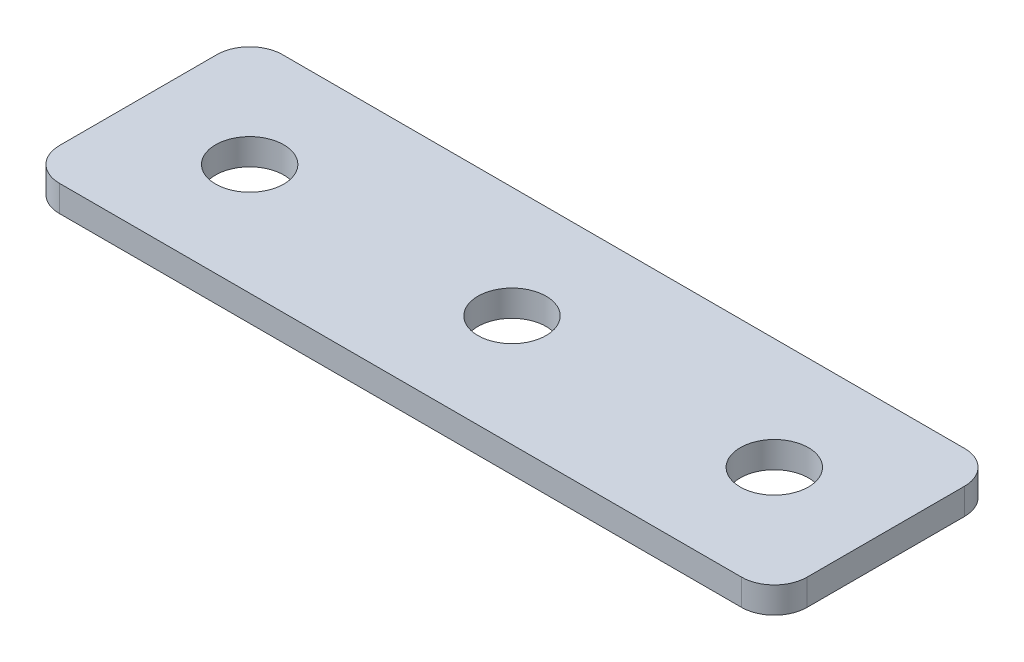
ISO-10303-21;
HEADER;
FILE_DESCRIPTION(('STEP AP214'),'2;1');
FILE_NAME('part.step','',(''),(''),'','','');
FILE_SCHEMA(('AUTOMOTIVE_DESIGN { 1 0 10303 214 1 1 1 1 }'));
ENDSEC;
DATA;
#1=APPLICATION_CONTEXT('core data for automotive mechanical design processes');
#2=APPLICATION_PROTOCOL_DEFINITION('international standard','automotive_design',2000,#1);
#3=PRODUCT_CONTEXT('',#1,'mechanical');
#4=PRODUCT('Part','Part','',(#3));
#5=PRODUCT_RELATED_PRODUCT_CATEGORY('part','',(#4));
#6=PRODUCT_DEFINITION_FORMATION('','',#4);
#7=PRODUCT_DEFINITION_CONTEXT('part definition',#1,'design');
#8=PRODUCT_DEFINITION('design','',#6,#7);
#9=PRODUCT_DEFINITION_SHAPE('','',#8);
#10=(LENGTH_UNIT() NAMED_UNIT(*) SI_UNIT(.MILLI.,.METRE.));
#11=(NAMED_UNIT(*) PLANE_ANGLE_UNIT() SI_UNIT($,.RADIAN.));
#12=(NAMED_UNIT(*) SI_UNIT($,.STERADIAN.) SOLID_ANGLE_UNIT());
#13=UNCERTAINTY_MEASURE_WITH_UNIT(LENGTH_MEASURE(1.E-05),#10,'distance_accuracy_value','');
#14=(GEOMETRIC_REPRESENTATION_CONTEXT(3) GLOBAL_UNCERTAINTY_ASSIGNED_CONTEXT((#13)) GLOBAL_UNIT_ASSIGNED_CONTEXT((#10,
#11,#12)) REPRESENTATION_CONTEXT('',''));
#15=CARTESIAN_POINT('',(0.,0.,0.));
#16=DIRECTION('',(0.,0.,1.));
#17=DIRECTION('',(1.,0.,0.));
#18=AXIS2_PLACEMENT_3D('',#15,#16,#17);
#19=CARTESIAN_POINT('',(-20.9120032783016,0.624792376219375,-0.712525045059916));
#20=DIRECTION('',(0.,-1.,0.));
#21=DIRECTION('',(0.,0.,-1.));
#22=AXIS2_PLACEMENT_3D('',#19,#20,#21);
#23=PLANE('',#22);
#24=CARTESIAN_POINT('',(19.0879967216984,0.624792376219375,-0.712525045059916));
#25=DIRECTION('',(0.,1.,0.));
#26=DIRECTION('',(0.,0.,1.));
#27=AXIS2_PLACEMENT_3D('',#24,#25,#26);
#28=CIRCLE('',#27,2.6);
#29=CARTESIAN_POINT('',(19.0879967216984,0.624792376219375,1.88747495494008));
#30=VERTEX_POINT('',#29);
#31=EDGE_CURVE('E163',#30,#30,#28,.T.);
#32=ORIENTED_EDGE('',*,*,#31,.T.);
#33=EDGE_LOOP('',(#32));
#34=FACE_BOUND('',#33,.T.);
#35=CARTESIAN_POINT('',(-0.912003278301585,0.624792376219375,-0.712525045059906));
#36=DIRECTION('',(0.,1.,0.));
#37=DIRECTION('',(0.,0.,1.));
#38=AXIS2_PLACEMENT_3D('',#35,#36,#37);
#39=CIRCLE('',#38,2.6);
#40=CARTESIAN_POINT('',(-0.912003278301585,0.624792376219375,1.88747495494009));
#41=VERTEX_POINT('',#40);
#42=EDGE_CURVE('E157',#41,#41,#39,.T.);
#43=ORIENTED_EDGE('',*,*,#42,.T.);
#44=EDGE_LOOP('',(#43));
#45=FACE_BOUND('',#44,.T.);
#46=CARTESIAN_POINT('',(-20.9120032783016,0.624792376219375,-0.712525045059916));
#47=DIRECTION('',(0.,1.,0.));
#48=DIRECTION('',(0.,0.,1.));
#49=AXIS2_PLACEMENT_3D('',#46,#47,#48);
#50=CIRCLE('',#49,2.6);
#51=CARTESIAN_POINT('',(-20.9120032783016,0.624792376219375,1.88747495494008));
#52=VERTEX_POINT('',#51);
#53=EDGE_CURVE('E103',#52,#52,#50,.T.);
#54=ORIENTED_EDGE('',*,*,#53,.T.);
#55=EDGE_LOOP('',(#54));
#56=FACE_BOUND('',#55,.T.);
#57=DIRECTION('',(0.,0.,-1.));
#58=VECTOR('',#57,1.);
#59=CARTESIAN_POINT('',(27.5879967216983,0.624792376219375,7.78747495494012));
#60=LINE('',#59,#58);
#61=CARTESIAN_POINT('',(27.5879967216983,0.624792376219375,5.28747495494012));
#62=VERTEX_POINT('',#61);
#63=CARTESIAN_POINT('',(27.5879967216983,0.624792376219375,-6.71252504505996));
#64=VERTEX_POINT('',#63);
#65=EDGE_CURVE('E150',#62,#64,#60,.T.);
#66=ORIENTED_EDGE('',*,*,#65,.F.);
#67=CARTESIAN_POINT('',(25.0879967216983,0.624792376219375,5.28747495494012));
#68=DIRECTION('',(0.,-1.,0.));
#69=DIRECTION('',(0.,0.,-1.));
#70=AXIS2_PLACEMENT_3D('',#67,#68,#69);
#71=CIRCLE('',#70,2.5);
#72=CARTESIAN_POINT('',(25.0879967216983,0.624792376219375,7.78747495494012));
#73=VERTEX_POINT('',#72);
#74=EDGE_CURVE('E130',#62,#73,#71,.T.);
#75=ORIENTED_EDGE('',*,*,#74,.T.);
#76=DIRECTION('',(1.,0.,0.));
#77=VECTOR('',#76,1.);
#78=CARTESIAN_POINT('',(-12.4120032783015,0.624792376219375,7.78747495494012));
#79=LINE('',#78,#77);
#80=CARTESIAN_POINT('',(-26.9120032783017,0.624792376219375,7.78747495494012));
#81=VERTEX_POINT('',#80);
#82=EDGE_CURVE('E146',#81,#73,#79,.T.);
#83=ORIENTED_EDGE('',*,*,#82,.F.);
#84=CARTESIAN_POINT('',(-26.9120032783017,0.624792376219375,5.28747495494012));
#85=DIRECTION('',(0.,-1.,0.));
#86=DIRECTION('',(0.,0.,-1.));
#87=AXIS2_PLACEMENT_3D('',#84,#85,#86);
#88=CIRCLE('',#87,2.5);
#89=CARTESIAN_POINT('',(-29.4120032783017,0.624792376219375,5.28747495494012));
#90=VERTEX_POINT('',#89);
#91=EDGE_CURVE('E106',#81,#90,#88,.T.);
#92=ORIENTED_EDGE('',*,*,#91,.T.);
#93=DIRECTION('',(0.,0.,1.));
#94=VECTOR('',#93,1.);
#95=CARTESIAN_POINT('',(-29.4120032783017,0.624792376219375,-9.21252504505995));
#96=LINE('',#95,#94);
#97=CARTESIAN_POINT('',(-29.4120032783017,0.624792376219375,-6.71252504505995));
#98=VERTEX_POINT('',#97);
#99=EDGE_CURVE('E107',#98,#90,#96,.T.);
#100=ORIENTED_EDGE('',*,*,#99,.F.);
#101=CARTESIAN_POINT('',(-26.9120032783017,0.624792376219375,-6.71252504505995));
#102=DIRECTION('',(0.,-1.,0.));
#103=DIRECTION('',(0.,0.,-1.));
#104=AXIS2_PLACEMENT_3D('',#101,#102,#103);
#105=CIRCLE('',#104,2.5);
#106=CARTESIAN_POINT('',(-26.9120032783017,0.624792376219375,-9.21252504505995));
#107=VERTEX_POINT('',#106);
#108=EDGE_CURVE('E31',#98,#107,#105,.T.);
#109=ORIENTED_EDGE('',*,*,#108,.T.);
#110=DIRECTION('',(-1.,0.,0.));
#111=VECTOR('',#110,1.);
#112=CARTESIAN_POINT('',(27.5879967216983,0.624792376219375,-9.21252504505996));
#113=LINE('',#112,#111);
#114=CARTESIAN_POINT('',(25.0879967216983,0.624792376219375,-9.21252504505996));
#115=VERTEX_POINT('',#114);
#116=EDGE_CURVE('E111',#115,#107,#113,.T.);
#117=ORIENTED_EDGE('',*,*,#116,.F.);
#118=CARTESIAN_POINT('',(25.0879967216983,0.624792376219375,-6.71252504505996));
#119=DIRECTION('',(0.,-1.,0.));
#120=DIRECTION('',(0.,0.,-1.));
#121=AXIS2_PLACEMENT_3D('',#118,#119,#120);
#122=CIRCLE('',#121,2.5);
#123=EDGE_CURVE('E128',#115,#64,#122,.T.);
#124=ORIENTED_EDGE('',*,*,#123,.T.);
#125=EDGE_LOOP('',(#66,#75,#83,#92,#100,#109,#117,#124));
#126=FACE_BOUND('',#125,.T.);
#127=ADVANCED_FACE('F16',(#34,#45,#56,#126),#23,.T.);
#128=CARTESIAN_POINT('',(-12.4120032783015,0.624792376219375,7.78747495494012));
#129=DIRECTION('',(0.,0.,1.));
#130=DIRECTION('',(1.,0.,0.));
#131=AXIS2_PLACEMENT_3D('',#128,#129,#130);
#132=PLANE('',#131);
#133=ORIENTED_EDGE('',*,*,#82,.T.);
#134=DIRECTION('',(0.,1.,0.));
#135=VECTOR('',#134,1.);
#136=CARTESIAN_POINT('',(25.0879967216983,0.624792376219375,7.78747495494012));
#137=LINE('',#136,#135);
#138=CARTESIAN_POINT('',(25.0879967216983,2.62479237621938,7.78747495494012));
#139=VERTEX_POINT('',#138);
#140=EDGE_CURVE('E93',#73,#139,#137,.T.);
#141=ORIENTED_EDGE('',*,*,#140,.T.);
#142=DIRECTION('',(1.,0.,0.));
#143=VECTOR('',#142,1.);
#144=CARTESIAN_POINT('',(-12.4120032783015,2.62479237621938,7.78747495494012));
#145=LINE('',#144,#143);
#146=CARTESIAN_POINT('',(-26.9120032783017,2.62479237621938,7.78747495494012));
#147=VERTEX_POINT('',#146);
#148=EDGE_CURVE('E85',#147,#139,#145,.T.);
#149=ORIENTED_EDGE('',*,*,#148,.F.);
#150=DIRECTION('',(0.,1.,0.));
#151=VECTOR('',#150,1.);
#152=CARTESIAN_POINT('',(-26.9120032783017,0.624792376219375,7.78747495494012));
#153=LINE('',#152,#151);
#154=EDGE_CURVE('E99',#147,#81,#153,.F.);
#155=ORIENTED_EDGE('',*,*,#154,.T.);
#156=EDGE_LOOP('',(#133,#141,#149,#155));
#157=FACE_BOUND('',#156,.T.);
#158=ADVANCED_FACE('F98',(#157),#132,.T.);
#159=CARTESIAN_POINT('',(-29.4120032783017,0.624792376219375,-9.21252504505995));
#160=DIRECTION('',(-1.,0.,0.));
#161=DIRECTION('',(0.,0.,1.));
#162=AXIS2_PLACEMENT_3D('',#159,#160,#161);
#163=PLANE('',#162);
#164=DIRECTION('',(0.,0.,1.));
#165=VECTOR('',#164,1.);
#166=CARTESIAN_POINT('',(-29.4120032783017,2.62479237621938,-9.21252504505995));
#167=LINE('',#166,#165);
#168=CARTESIAN_POINT('',(-29.4120032783017,2.62479237621938,-6.71252504505995));
#169=VERTEX_POINT('',#168);
#170=CARTESIAN_POINT('',(-29.4120032783017,2.62479237621938,5.28747495494012));
#171=VERTEX_POINT('',#170);
#172=EDGE_CURVE('E87',#169,#171,#167,.T.);
#173=ORIENTED_EDGE('',*,*,#172,.F.);
#174=DIRECTION('',(0.,1.,0.));
#175=VECTOR('',#174,1.);
#176=CARTESIAN_POINT('',(-29.4120032783017,0.624792376219375,-6.71252504505995));
#177=LINE('',#176,#175);
#178=EDGE_CURVE('E10',#169,#98,#177,.F.);
#179=ORIENTED_EDGE('',*,*,#178,.T.);
#180=ORIENTED_EDGE('',*,*,#99,.T.);
#181=DIRECTION('',(0.,1.,0.));
#182=VECTOR('',#181,1.);
#183=CARTESIAN_POINT('',(-29.4120032783017,0.624792376219375,5.28747495494012));
#184=LINE('',#183,#182);
#185=EDGE_CURVE('E24',#90,#171,#184,.T.);
#186=ORIENTED_EDGE('',*,*,#185,.T.);
#187=EDGE_LOOP('',(#173,#179,#180,#186));
#188=FACE_BOUND('',#187,.T.);
#189=ADVANCED_FACE('F136',(#188),#163,.T.);
#190=CARTESIAN_POINT('',(27.5879967216983,0.624792376219375,-9.21252504505996));
#191=DIRECTION('',(0.,0.,-1.));
#192=DIRECTION('',(-1.,0.,0.));
#193=AXIS2_PLACEMENT_3D('',#190,#191,#192);
#194=PLANE('',#193);
#195=DIRECTION('',(-1.,0.,0.));
#196=VECTOR('',#195,1.);
#197=CARTESIAN_POINT('',(27.5879967216983,2.62479237621938,-9.21252504505996));
#198=LINE('',#197,#196);
#199=CARTESIAN_POINT('',(25.0879967216983,2.62479237621938,-9.21252504505996));
#200=VERTEX_POINT('',#199);
#201=CARTESIAN_POINT('',(-26.9120032783017,2.62479237621938,-9.21252504505995));
#202=VERTEX_POINT('',#201);
#203=EDGE_CURVE('E144',#200,#202,#198,.T.);
#204=ORIENTED_EDGE('',*,*,#203,.F.);
#205=DIRECTION('',(0.,1.,0.));
#206=VECTOR('',#205,1.);
#207=CARTESIAN_POINT('',(25.0879967216983,0.624792376219375,-9.21252504505996));
#208=LINE('',#207,#206);
#209=EDGE_CURVE('E38',#200,#115,#208,.F.);
#210=ORIENTED_EDGE('',*,*,#209,.T.);
#211=ORIENTED_EDGE('',*,*,#116,.T.);
#212=DIRECTION('',(0.,1.,0.));
#213=VECTOR('',#212,1.);
#214=CARTESIAN_POINT('',(-26.9120032783017,0.624792376219375,-9.21252504505995));
#215=LINE('',#214,#213);
#216=EDGE_CURVE('E132',#107,#202,#215,.T.);
#217=ORIENTED_EDGE('',*,*,#216,.T.);
#218=EDGE_LOOP('',(#204,#210,#211,#217));
#219=FACE_BOUND('',#218,.T.);
#220=ADVANCED_FACE('F143',(#219),#194,.T.);
#221=CARTESIAN_POINT('',(27.5879967216983,0.624792376219375,7.78747495494012));
#222=DIRECTION('',(1.,0.,0.));
#223=DIRECTION('',(0.,0.,-1.));
#224=AXIS2_PLACEMENT_3D('',#221,#222,#223);
#225=PLANE('',#224);
#226=DIRECTION('',(0.,0.,-1.));
#227=VECTOR('',#226,1.);
#228=CARTESIAN_POINT('',(27.5879967216983,2.62479237621938,7.78747495494012));
#229=LINE('',#228,#227);
#230=CARTESIAN_POINT('',(27.5879967216983,2.62479237621938,5.28747495494012));
#231=VERTEX_POINT('',#230);
#232=CARTESIAN_POINT('',(27.5879967216983,2.62479237621938,-6.71252504505996));
#233=VERTEX_POINT('',#232);
#234=EDGE_CURVE('E102',#231,#233,#229,.T.);
#235=ORIENTED_EDGE('',*,*,#234,.F.);
#236=DIRECTION('',(0.,1.,0.));
#237=VECTOR('',#236,1.);
#238=CARTESIAN_POINT('',(27.5879967216983,0.624792376219375,5.28747495494012));
#239=LINE('',#238,#237);
#240=EDGE_CURVE('E124',#231,#62,#239,.F.);
#241=ORIENTED_EDGE('',*,*,#240,.T.);
#242=ORIENTED_EDGE('',*,*,#65,.T.);
#243=DIRECTION('',(0.,1.,0.));
#244=VECTOR('',#243,1.);
#245=CARTESIAN_POINT('',(27.5879967216983,0.624792376219375,-6.71252504505996));
#246=LINE('',#245,#244);
#247=EDGE_CURVE('E121',#64,#233,#246,.T.);
#248=ORIENTED_EDGE('',*,*,#247,.T.);
#249=EDGE_LOOP('',(#235,#241,#242,#248));
#250=FACE_BOUND('',#249,.T.);
#251=ADVANCED_FACE('F185',(#250),#225,.T.);
#252=CARTESIAN_POINT('',(-20.9120032783016,2.62479237621938,-0.712525045059916));
#253=DIRECTION('',(0.,-1.,0.));
#254=DIRECTION('',(0.,0.,-1.));
#255=AXIS2_PLACEMENT_3D('',#252,#253,#254);
#256=PLANE('',#255);
#257=CARTESIAN_POINT('',(19.0879967216984,2.62479237621938,-0.712525045059916));
#258=DIRECTION('',(0.,1.,0.));
#259=DIRECTION('',(0.,0.,1.));
#260=AXIS2_PLACEMENT_3D('',#257,#258,#259);
#261=CIRCLE('',#260,2.6);
#262=CARTESIAN_POINT('',(19.0879967216984,2.62479237621938,1.88747495494008));
#263=VERTEX_POINT('',#262);
#264=EDGE_CURVE('E166',#263,#263,#261,.T.);
#265=ORIENTED_EDGE('',*,*,#264,.F.);
#266=EDGE_LOOP('',(#265));
#267=FACE_BOUND('',#266,.T.);
#268=CARTESIAN_POINT('',(-0.912003278301585,2.62479237621938,-0.712525045059906));
#269=DIRECTION('',(0.,1.,0.));
#270=DIRECTION('',(0.,0.,1.));
#271=AXIS2_PLACEMENT_3D('',#268,#269,#270);
#272=CIRCLE('',#271,2.6);
#273=CARTESIAN_POINT('',(-0.912003278301585,2.62479237621938,1.88747495494009));
#274=VERTEX_POINT('',#273);
#275=EDGE_CURVE('E160',#274,#274,#272,.T.);
#276=ORIENTED_EDGE('',*,*,#275,.F.);
#277=EDGE_LOOP('',(#276));
#278=FACE_BOUND('',#277,.T.);
#279=CARTESIAN_POINT('',(-20.9120032783016,2.62479237621938,-0.712525045059916));
#280=DIRECTION('',(0.,1.,0.));
#281=DIRECTION('',(0.,0.,1.));
#282=AXIS2_PLACEMENT_3D('',#279,#280,#281);
#283=CIRCLE('',#282,2.6);
#284=CARTESIAN_POINT('',(-20.9120032783016,2.62479237621938,1.88747495494008));
#285=VERTEX_POINT('',#284);
#286=EDGE_CURVE('E154',#285,#285,#283,.T.);
#287=ORIENTED_EDGE('',*,*,#286,.F.);
#288=EDGE_LOOP('',(#287));
#289=FACE_BOUND('',#288,.T.);
#290=ORIENTED_EDGE('',*,*,#148,.T.);
#291=CARTESIAN_POINT('',(25.0879967216983,2.62479237621938,5.28747495494012));
#292=DIRECTION('',(0.,-1.,0.));
#293=DIRECTION('',(0.,0.,-1.));
#294=AXIS2_PLACEMENT_3D('',#291,#292,#293);
#295=CIRCLE('',#294,2.5);
#296=EDGE_CURVE('E119',#139,#231,#295,.F.);
#297=ORIENTED_EDGE('',*,*,#296,.T.);
#298=ORIENTED_EDGE('',*,*,#234,.T.);
#299=CARTESIAN_POINT('',(25.0879967216983,2.62479237621938,-6.71252504505996));
#300=DIRECTION('',(0.,-1.,0.));
#301=DIRECTION('',(0.,0.,-1.));
#302=AXIS2_PLACEMENT_3D('',#299,#300,#301);
#303=CIRCLE('',#302,2.5);
#304=EDGE_CURVE('E117',#233,#200,#303,.F.);
#305=ORIENTED_EDGE('',*,*,#304,.T.);
#306=ORIENTED_EDGE('',*,*,#203,.T.);
#307=CARTESIAN_POINT('',(-26.9120032783017,2.62479237621938,-6.71252504505995));
#308=DIRECTION('',(0.,-1.,0.));
#309=DIRECTION('',(0.,0.,-1.));
#310=AXIS2_PLACEMENT_3D('',#307,#308,#309);
#311=CIRCLE('',#310,2.5);
#312=EDGE_CURVE('E92',#202,#169,#311,.F.);
#313=ORIENTED_EDGE('',*,*,#312,.T.);
#314=ORIENTED_EDGE('',*,*,#172,.T.);
#315=CARTESIAN_POINT('',(-26.9120032783017,2.62479237621938,5.28747495494012));
#316=DIRECTION('',(0.,-1.,0.));
#317=DIRECTION('',(0.,0.,-1.));
#318=AXIS2_PLACEMENT_3D('',#315,#316,#317);
#319=CIRCLE('',#318,2.5);
#320=EDGE_CURVE('E82',#171,#147,#319,.F.);
#321=ORIENTED_EDGE('',*,*,#320,.T.);
#322=EDGE_LOOP('',(#290,#297,#298,#305,#306,#313,#314,#321));
#323=FACE_BOUND('',#322,.T.);
#324=ADVANCED_FACE('F84',(#267,#278,#289,#323),#256,.F.);
#325=CARTESIAN_POINT('',(-20.9120032783016,0.624792376219375,-0.712525045059916));
#326=DIRECTION('',(0.,1.,0.));
#327=DIRECTION('',(0.,0.,1.));
#328=AXIS2_PLACEMENT_3D('',#325,#326,#327);
#329=CYLINDRICAL_SURFACE('',#328,2.6);
#330=ORIENTED_EDGE('',*,*,#53,.F.);
#331=EDGE_LOOP('',(#330));
#332=FACE_BOUND('',#331,.T.);
#333=ORIENTED_EDGE('',*,*,#286,.T.);
#334=EDGE_LOOP('',(#333));
#335=FACE_BOUND('',#334,.T.);
#336=ADVANCED_FACE('F184',(#332,#335),#329,.F.);
#337=CARTESIAN_POINT('',(-0.912003278301585,0.624792376219375,-0.712525045059906));
#338=DIRECTION('',(0.,1.,0.));
#339=DIRECTION('',(0.,0.,1.));
#340=AXIS2_PLACEMENT_3D('',#337,#338,#339);
#341=CYLINDRICAL_SURFACE('',#340,2.6);
#342=ORIENTED_EDGE('',*,*,#42,.F.);
#343=EDGE_LOOP('',(#342));
#344=FACE_BOUND('',#343,.T.);
#345=ORIENTED_EDGE('',*,*,#275,.T.);
#346=EDGE_LOOP('',(#345));
#347=FACE_BOUND('',#346,.T.);
#348=ADVANCED_FACE('F178',(#344,#347),#341,.F.);
#349=CARTESIAN_POINT('',(19.0879967216984,0.624792376219375,-0.712525045059916));
#350=DIRECTION('',(0.,1.,0.));
#351=DIRECTION('',(0.,0.,1.));
#352=AXIS2_PLACEMENT_3D('',#349,#350,#351);
#353=CYLINDRICAL_SURFACE('',#352,2.6);
#354=ORIENTED_EDGE('',*,*,#31,.F.);
#355=EDGE_LOOP('',(#354));
#356=FACE_BOUND('',#355,.T.);
#357=ORIENTED_EDGE('',*,*,#264,.T.);
#358=EDGE_LOOP('',(#357));
#359=FACE_BOUND('',#358,.T.);
#360=ADVANCED_FACE('F174',(#356,#359),#353,.F.);
#361=CARTESIAN_POINT('',(25.0879967216983,0.624792376219375,5.28747495494012));
#362=DIRECTION('',(0.,1.,0.));
#363=DIRECTION('',(0.,0.,1.));
#364=AXIS2_PLACEMENT_3D('',#361,#362,#363);
#365=CYLINDRICAL_SURFACE('',#364,2.5);
#366=ORIENTED_EDGE('',*,*,#74,.F.);
#367=ORIENTED_EDGE('',*,*,#240,.F.);
#368=ORIENTED_EDGE('',*,*,#296,.F.);
#369=ORIENTED_EDGE('',*,*,#140,.F.);
#370=EDGE_LOOP('',(#366,#367,#368,#369));
#371=FACE_BOUND('',#370,.T.);
#372=ADVANCED_FACE('F177',(#371),#365,.T.);
#373=CARTESIAN_POINT('',(25.0879967216983,0.624792376219375,-6.71252504505996));
#374=DIRECTION('',(0.,1.,0.));
#375=DIRECTION('',(0.,0.,1.));
#376=AXIS2_PLACEMENT_3D('',#373,#374,#375);
#377=CYLINDRICAL_SURFACE('',#376,2.5);
#378=ORIENTED_EDGE('',*,*,#123,.F.);
#379=ORIENTED_EDGE('',*,*,#209,.F.);
#380=ORIENTED_EDGE('',*,*,#304,.F.);
#381=ORIENTED_EDGE('',*,*,#247,.F.);
#382=EDGE_LOOP('',(#378,#379,#380,#381));
#383=FACE_BOUND('',#382,.T.);
#384=ADVANCED_FACE('F211',(#383),#377,.T.);
#385=CARTESIAN_POINT('',(-26.9120032783017,0.624792376219375,-6.71252504505995));
#386=DIRECTION('',(0.,1.,0.));
#387=DIRECTION('',(0.,0.,1.));
#388=AXIS2_PLACEMENT_3D('',#385,#386,#387);
#389=CYLINDRICAL_SURFACE('',#388,2.5);
#390=ORIENTED_EDGE('',*,*,#108,.F.);
#391=ORIENTED_EDGE('',*,*,#178,.F.);
#392=ORIENTED_EDGE('',*,*,#312,.F.);
#393=ORIENTED_EDGE('',*,*,#216,.F.);
#394=EDGE_LOOP('',(#390,#391,#392,#393));
#395=FACE_BOUND('',#394,.T.);
#396=ADVANCED_FACE('F141',(#395),#389,.T.);
#397=CARTESIAN_POINT('',(-26.9120032783017,0.624792376219375,5.28747495494012));
#398=DIRECTION('',(0.,1.,0.));
#399=DIRECTION('',(0.,0.,1.));
#400=AXIS2_PLACEMENT_3D('',#397,#398,#399);
#401=CYLINDRICAL_SURFACE('',#400,2.5);
#402=ORIENTED_EDGE('',*,*,#91,.F.);
#403=ORIENTED_EDGE('',*,*,#154,.F.);
#404=ORIENTED_EDGE('',*,*,#320,.F.);
#405=ORIENTED_EDGE('',*,*,#185,.F.);
#406=EDGE_LOOP('',(#402,#403,#404,#405));
#407=FACE_BOUND('',#406,.T.);
#408=ADVANCED_FACE('F18',(#407),#401,.T.);
#409=CLOSED_SHELL('',(#127,#158,#189,#220,#251,#324,#336,#348,#360,#372,#384,#396,#408));
#410=MANIFOLD_SOLID_BREP('B1',#409);
#411=ADVANCED_BREP_SHAPE_REPRESENTATION('',(#18,#410),#14);
#412=SHAPE_DEFINITION_REPRESENTATION(#9,#411);
ENDSEC;
END-ISO-10303-21;
